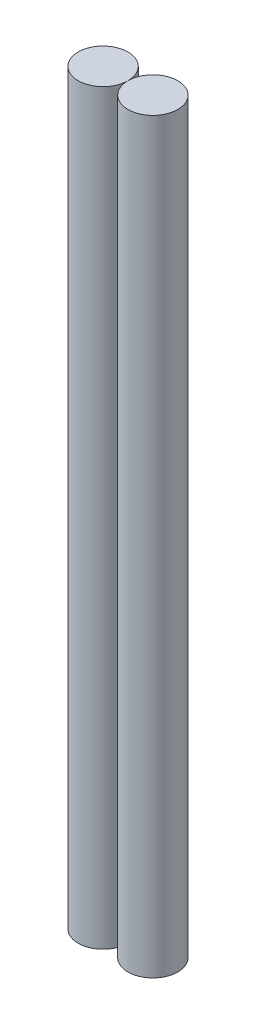
ISO-10303-21;
HEADER;
FILE_DESCRIPTION(('STEP AP214'),'2;1');
FILE_NAME('part.step','',(''),(''),'','','');
FILE_SCHEMA(('AUTOMOTIVE_DESIGN { 1 0 10303 214 1 1 1 1 }'));
ENDSEC;
DATA;
#1=APPLICATION_CONTEXT('core data for automotive mechanical design processes');
#2=APPLICATION_PROTOCOL_DEFINITION('international standard','automotive_design',2000,#1);
#3=PRODUCT_CONTEXT('',#1,'mechanical');
#4=PRODUCT('Part','Part','',(#3));
#5=PRODUCT_RELATED_PRODUCT_CATEGORY('part','',(#4));
#6=PRODUCT_DEFINITION_FORMATION('','',#4);
#7=PRODUCT_DEFINITION_CONTEXT('part definition',#1,'design');
#8=PRODUCT_DEFINITION('design','',#6,#7);
#9=PRODUCT_DEFINITION_SHAPE('','',#8);
#10=(LENGTH_UNIT() NAMED_UNIT(*) SI_UNIT(.MILLI.,.METRE.));
#11=(NAMED_UNIT(*) PLANE_ANGLE_UNIT() SI_UNIT($,.RADIAN.));
#12=(NAMED_UNIT(*) SI_UNIT($,.STERADIAN.) SOLID_ANGLE_UNIT());
#13=UNCERTAINTY_MEASURE_WITH_UNIT(LENGTH_MEASURE(1.E-05),#10,'distance_accuracy_value','');
#14=(GEOMETRIC_REPRESENTATION_CONTEXT(3) GLOBAL_UNCERTAINTY_ASSIGNED_CONTEXT((#13)) GLOBAL_UNIT_ASSIGNED_CONTEXT((#10,
#11,#12)) REPRESENTATION_CONTEXT('',''));
#15=CARTESIAN_POINT('',(0.,0.,0.));
#16=DIRECTION('',(0.,0.,1.));
#17=DIRECTION('',(1.,0.,0.));
#18=AXIS2_PLACEMENT_3D('',#15,#16,#17);
#19=CARTESIAN_POINT('',(18.,270.,0.));
#20=DIRECTION('',(0.,-1.,0.));
#21=DIRECTION('',(0.,0.,-1.));
#22=AXIS2_PLACEMENT_3D('',#19,#20,#21);
#23=CYLINDRICAL_SURFACE('',#22,9.00000000000001);
#24=CARTESIAN_POINT('',(18.,270.,0.));
#25=DIRECTION('',(0.,1.,0.));
#26=DIRECTION('',(0.,0.,1.));
#27=AXIS2_PLACEMENT_3D('',#24,#25,#26);
#28=CIRCLE('',#27,9.00000000000001);
#29=CARTESIAN_POINT('',(18.,270.,9.00000000000001));
#30=VERTEX_POINT('',#29);
#31=EDGE_CURVE('E12',#30,#30,#28,.T.);
#32=ORIENTED_EDGE('',*,*,#31,.F.);
#33=EDGE_LOOP('',(#32));
#34=FACE_BOUND('',#33,.T.);
#35=CARTESIAN_POINT('',(18.,0.,0.));
#36=DIRECTION('',(0.,1.,0.));
#37=DIRECTION('',(0.,0.,1.));
#38=AXIS2_PLACEMENT_3D('',#35,#36,#37);
#39=CIRCLE('',#38,9.00000000000001);
#40=CARTESIAN_POINT('',(18.,0.,9.00000000000001));
#41=VERTEX_POINT('',#40);
#42=EDGE_CURVE('E50',#41,#41,#39,.T.);
#43=ORIENTED_EDGE('',*,*,#42,.T.);
#44=EDGE_LOOP('',(#43));
#45=FACE_BOUND('',#44,.T.);
#46=ADVANCED_FACE('F47',(#34,#45),#23,.T.);
#47=CARTESIAN_POINT('',(0.,270.,0.));
#48=DIRECTION('',(0.,1.,0.));
#49=DIRECTION('',(0.,0.,1.));
#50=AXIS2_PLACEMENT_3D('',#47,#48,#49);
#51=PLANE('',#50);
#52=ORIENTED_EDGE('',*,*,#31,.T.);
#53=EDGE_LOOP('',(#52));
#54=FACE_BOUND('',#53,.T.);
#55=ADVANCED_FACE('F62',(#54),#51,.T.);
#56=CARTESIAN_POINT('',(0.,0.,0.));
#57=DIRECTION('',(0.,1.,0.));
#58=DIRECTION('',(0.,0.,1.));
#59=AXIS2_PLACEMENT_3D('',#56,#57,#58);
#60=PLANE('',#59);
#61=ORIENTED_EDGE('',*,*,#42,.F.);
#62=EDGE_LOOP('',(#61));
#63=FACE_BOUND('',#62,.T.);
#64=ADVANCED_FACE('F60',(#63),#60,.F.);
#65=CLOSED_SHELL('',(#46,#55,#64));
#66=MANIFOLD_SOLID_BREP('B2',#65);
#67=CARTESIAN_POINT('',(0.,270.,0.));
#68=DIRECTION('',(0.,-1.,0.));
#69=DIRECTION('',(0.,0.,-1.));
#70=AXIS2_PLACEMENT_3D('',#67,#68,#69);
#71=CYLINDRICAL_SURFACE('',#70,9.);
#72=CARTESIAN_POINT('',(0.,270.,0.));
#73=DIRECTION('',(0.,1.,0.));
#74=DIRECTION('',(0.,0.,1.));
#75=AXIS2_PLACEMENT_3D('',#72,#73,#74);
#76=CIRCLE('',#75,9.);
#77=CARTESIAN_POINT('',(0.,270.,9.));
#78=VERTEX_POINT('',#77);
#79=EDGE_CURVE('E46',#78,#78,#76,.T.);
#80=ORIENTED_EDGE('',*,*,#79,.F.);
#81=EDGE_LOOP('',(#80));
#82=FACE_BOUND('',#81,.T.);
#83=CARTESIAN_POINT('',(0.,0.,0.));
#84=DIRECTION('',(0.,1.,0.));
#85=DIRECTION('',(0.,0.,1.));
#86=AXIS2_PLACEMENT_3D('',#83,#84,#85);
#87=CIRCLE('',#86,9.);
#88=CARTESIAN_POINT('',(0.,0.,9.));
#89=VERTEX_POINT('',#88);
#90=EDGE_CURVE('E91',#89,#89,#87,.T.);
#91=ORIENTED_EDGE('',*,*,#90,.T.);
#92=EDGE_LOOP('',(#91));
#93=FACE_BOUND('',#92,.T.);
#94=ADVANCED_FACE('F88',(#82,#93),#71,.T.);
#95=CARTESIAN_POINT('',(0.,270.,0.));
#96=DIRECTION('',(0.,1.,0.));
#97=DIRECTION('',(0.,0.,1.));
#98=AXIS2_PLACEMENT_3D('',#95,#96,#97);
#99=PLANE('',#98);
#100=ORIENTED_EDGE('',*,*,#79,.T.);
#101=EDGE_LOOP('',(#100));
#102=FACE_BOUND('',#101,.T.);
#103=ADVANCED_FACE('F103',(#102),#99,.T.);
#104=CARTESIAN_POINT('',(0.,0.,0.));
#105=DIRECTION('',(0.,1.,0.));
#106=DIRECTION('',(0.,0.,1.));
#107=AXIS2_PLACEMENT_3D('',#104,#105,#106);
#108=PLANE('',#107);
#109=ORIENTED_EDGE('',*,*,#90,.F.);
#110=EDGE_LOOP('',(#109));
#111=FACE_BOUND('',#110,.T.);
#112=ADVANCED_FACE('F101',(#111),#108,.F.);
#113=CLOSED_SHELL('',(#94,#103,#112));
#114=MANIFOLD_SOLID_BREP('B7',#113);
#115=ADVANCED_BREP_SHAPE_REPRESENTATION('',(#18,#66,#114),#14);
#116=SHAPE_DEFINITION_REPRESENTATION(#9,#115);
ENDSEC;
END-ISO-10303-21;
